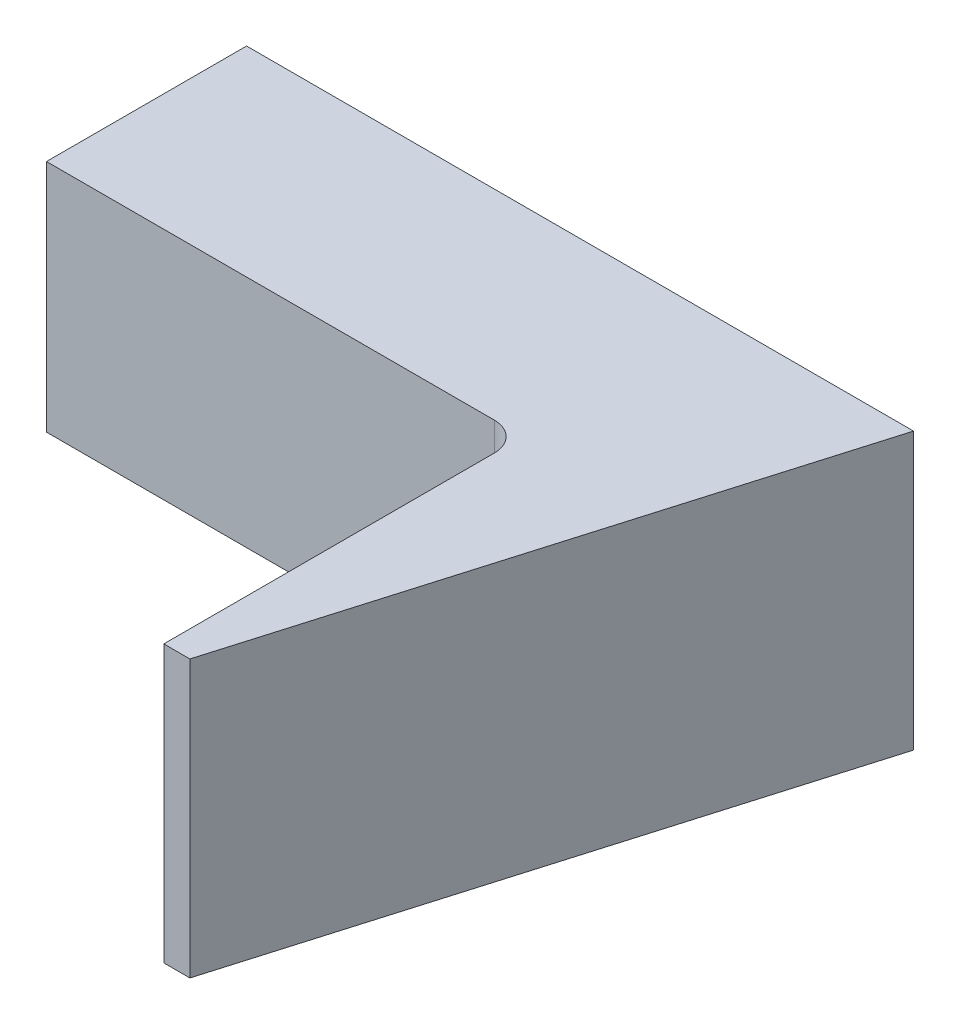
ISO-10303-21;
HEADER;
FILE_DESCRIPTION(('STEP AP214'),'2;1');
FILE_NAME('part.step','',(''),(''),'','','');
FILE_SCHEMA(('AUTOMOTIVE_DESIGN { 1 0 10303 214 1 1 1 1 }'));
ENDSEC;
DATA;
#1=APPLICATION_CONTEXT('core data for automotive mechanical design processes');
#2=APPLICATION_PROTOCOL_DEFINITION('international standard','automotive_design',2000,#1);
#3=PRODUCT_CONTEXT('',#1,'mechanical');
#4=PRODUCT('Part','Part','',(#3));
#5=PRODUCT_RELATED_PRODUCT_CATEGORY('part','',(#4));
#6=PRODUCT_DEFINITION_FORMATION('','',#4);
#7=PRODUCT_DEFINITION_CONTEXT('part definition',#1,'design');
#8=PRODUCT_DEFINITION('design','',#6,#7);
#9=PRODUCT_DEFINITION_SHAPE('','',#8);
#10=(LENGTH_UNIT() NAMED_UNIT(*) SI_UNIT(.MILLI.,.METRE.));
#11=(NAMED_UNIT(*) PLANE_ANGLE_UNIT() SI_UNIT($,.RADIAN.));
#12=(NAMED_UNIT(*) SI_UNIT($,.STERADIAN.) SOLID_ANGLE_UNIT());
#13=UNCERTAINTY_MEASURE_WITH_UNIT(LENGTH_MEASURE(1.E-05),#10,'distance_accuracy_value','');
#14=(GEOMETRIC_REPRESENTATION_CONTEXT(3) GLOBAL_UNCERTAINTY_ASSIGNED_CONTEXT((#13)) GLOBAL_UNIT_ASSIGNED_CONTEXT((#10,
#11,#12)) REPRESENTATION_CONTEXT('',''));
#15=CARTESIAN_POINT('',(0.,0.,0.));
#16=DIRECTION('',(0.,0.,1.));
#17=DIRECTION('',(1.,0.,0.));
#18=AXIS2_PLACEMENT_3D('',#15,#16,#17);
#19=CARTESIAN_POINT('',(0.,0.,5.334));
#20=DIRECTION('',(0.,0.,1.));
#21=DIRECTION('',(1.,0.,0.));
#22=AXIS2_PLACEMENT_3D('',#19,#20,#21);
#23=PLANE('',#22);
#24=DIRECTION('',(0.,-1.,0.));
#25=VECTOR('',#24,1.);
#26=CARTESIAN_POINT('',(-5.08,0.,5.334));
#27=LINE('',#26,#25);
#28=CARTESIAN_POINT('',(-5.08,3.683,5.334));
#29=VERTEX_POINT('',#28);
#30=CARTESIAN_POINT('',(-5.08,3.1496,5.334));
#31=VERTEX_POINT('',#30);
#32=EDGE_CURVE('E57',#29,#31,#27,.T.);
#33=ORIENTED_EDGE('',*,*,#32,.F.);
#34=DIRECTION('',(1.,0.,0.));
#35=VECTOR('',#34,1.);
#36=CARTESIAN_POINT('',(0.,3.683,5.334));
#37=LINE('',#36,#35);
#38=CARTESIAN_POINT('',(-5.842,3.683,5.334));
#39=VERTEX_POINT('',#38);
#40=EDGE_CURVE('E179',#39,#29,#37,.T.);
#41=ORIENTED_EDGE('',*,*,#40,.F.);
#42=DIRECTION('',(0.,-1.,0.));
#43=VECTOR('',#42,1.);
#44=CARTESIAN_POINT('',(-5.842,0.,5.334));
#45=LINE('',#44,#43);
#46=CARTESIAN_POINT('',(-5.842,9.398,5.334));
#47=VERTEX_POINT('',#46);
#48=EDGE_CURVE('E202',#39,#47,#45,.F.);
#49=ORIENTED_EDGE('',*,*,#48,.T.);
#50=DIRECTION('',(-1.,0.,0.));
#51=VECTOR('',#50,1.);
#52=CARTESIAN_POINT('',(-25.4,9.398,5.334));
#53=LINE('',#52,#51);
#54=CARTESIAN_POINT('',(-17.78,9.398,5.334));
#55=VERTEX_POINT('',#54);
#56=EDGE_CURVE('E193',#47,#55,#53,.T.);
#57=ORIENTED_EDGE('',*,*,#56,.T.);
#58=DIRECTION('',(0.,-1.,0.));
#59=VECTOR('',#58,1.);
#60=CARTESIAN_POINT('',(-17.78,49.5659336330003,5.334));
#61=LINE('',#60,#59);
#62=CARTESIAN_POINT('',(-17.78,3.1496,5.334));
#63=VERTEX_POINT('',#62);
#64=EDGE_CURVE('E159',#55,#63,#61,.T.);
#65=ORIENTED_EDGE('',*,*,#64,.T.);
#66=DIRECTION('',(1.,0.,0.));
#67=VECTOR('',#66,1.);
#68=CARTESIAN_POINT('',(-49.8353799348337,3.1496,5.334));
#69=LINE('',#68,#67);
#70=EDGE_CURVE('E156',#63,#31,#69,.T.);
#71=ORIENTED_EDGE('',*,*,#70,.T.);
#72=EDGE_LOOP('',(#33,#41,#49,#57,#65,#71));
#73=FACE_BOUND('',#72,.T.);
#74=ADVANCED_FACE('F41',(#73),#23,.T.);
#75=CARTESIAN_POINT('',(0.,0.,0.));
#76=DIRECTION('',(0.,0.,1.));
#77=DIRECTION('',(1.,0.,0.));
#78=AXIS2_PLACEMENT_3D('',#75,#76,#77);
#79=PLANE('',#78);
#80=DIRECTION('',(0.,-1.,0.));
#81=VECTOR('',#80,1.);
#82=CARTESIAN_POINT('',(-17.78,49.5659336330003,0.));
#83=LINE('',#82,#81);
#84=CARTESIAN_POINT('',(-17.78,9.398,0.));
#85=VERTEX_POINT('',#84);
#86=CARTESIAN_POINT('',(-17.78,3.1496,0.));
#87=VERTEX_POINT('',#86);
#88=EDGE_CURVE('E121',#85,#87,#83,.T.);
#89=ORIENTED_EDGE('',*,*,#88,.F.);
#90=DIRECTION('',(-1.,0.,0.));
#91=VECTOR('',#90,1.);
#92=CARTESIAN_POINT('',(-25.4,9.398,0.));
#93=LINE('',#92,#91);
#94=CARTESIAN_POINT('',(0.,9.398,0.));
#95=VERTEX_POINT('',#94);
#96=EDGE_CURVE('E198',#95,#85,#93,.T.);
#97=ORIENTED_EDGE('',*,*,#96,.F.);
#98=DIRECTION('',(0.,1.,0.));
#99=VECTOR('',#98,1.);
#100=CARTESIAN_POINT('',(0.,9.398,0.));
#101=LINE('',#100,#99);
#102=CARTESIAN_POINT('',(0.,2.032,0.));
#103=VERTEX_POINT('',#102);
#104=EDGE_CURVE('E213',#103,#95,#101,.T.);
#105=ORIENTED_EDGE('',*,*,#104,.F.);
#106=DIRECTION('',(-1.,0.,0.));
#107=VECTOR('',#106,1.);
#108=CARTESIAN_POINT('',(-5.08,2.032,0.));
#109=LINE('',#108,#107);
#110=CARTESIAN_POINT('',(-5.08,2.032,0.));
#111=VERTEX_POINT('',#110);
#112=EDGE_CURVE('E132',#103,#111,#109,.T.);
#113=ORIENTED_EDGE('',*,*,#112,.T.);
#114=DIRECTION('',(0.,1.,0.));
#115=VECTOR('',#114,1.);
#116=CARTESIAN_POINT('',(-5.08,2.032,0.));
#117=LINE('',#116,#115);
#118=CARTESIAN_POINT('',(-5.08,3.1496,0.));
#119=VERTEX_POINT('',#118);
#120=EDGE_CURVE('E146',#111,#119,#117,.T.);
#121=ORIENTED_EDGE('',*,*,#120,.T.);
#122=DIRECTION('',(1.,0.,0.));
#123=VECTOR('',#122,1.);
#124=CARTESIAN_POINT('',(-49.8353799348337,3.1496,0.));
#125=LINE('',#124,#123);
#126=EDGE_CURVE('E155',#87,#119,#125,.T.);
#127=ORIENTED_EDGE('',*,*,#126,.F.);
#128=EDGE_LOOP('',(#89,#97,#105,#113,#121,#127));
#129=FACE_BOUND('',#128,.T.);
#130=ADVANCED_FACE('F235',(#129),#79,.F.);
#131=CARTESIAN_POINT('',(-5.08,9.398,18.034));
#132=DIRECTION('',(1.,0.,0.));
#133=DIRECTION('',(0.,1.,0.));
#134=AXIS2_PLACEMENT_3D('',#131,#132,#133);
#135=PLANE('',#134);
#136=DIRECTION('',(0.,-1.,0.));
#137=VECTOR('',#136,1.);
#138=CARTESIAN_POINT('',(-5.08,58.1697636452282,14.9067716481666));
#139=LINE('',#138,#137);
#140=CARTESIAN_POINT('',(-5.08,9.398,14.9067716481666));
#141=VERTEX_POINT('',#140);
#142=CARTESIAN_POINT('',(-5.08,2.032,14.9067716481666));
#143=VERTEX_POINT('',#142);
#144=EDGE_CURVE('E137',#141,#143,#139,.T.);
#145=ORIENTED_EDGE('',*,*,#144,.F.);
#146=DIRECTION('',(0.,0.,-1.));
#147=VECTOR('',#146,1.);
#148=CARTESIAN_POINT('',(-5.08,9.398,18.034));
#149=LINE('',#148,#147);
#150=CARTESIAN_POINT('',(-5.08,9.398,6.096));
#151=VERTEX_POINT('',#150);
#152=EDGE_CURVE('E190',#141,#151,#149,.T.);
#153=ORIENTED_EDGE('',*,*,#152,.T.);
#154=DIRECTION('',(0.,-1.,0.));
#155=VECTOR('',#154,1.);
#156=CARTESIAN_POINT('',(-5.08,9.398,6.096));
#157=LINE('',#156,#155);
#158=CARTESIAN_POINT('',(-5.08,3.683,6.096));
#159=VERTEX_POINT('',#158);
#160=EDGE_CURVE('E197',#151,#159,#157,.T.);
#161=ORIENTED_EDGE('',*,*,#160,.T.);
#162=DIRECTION('',(0.,0.,1.));
#163=VECTOR('',#162,1.);
#164=CARTESIAN_POINT('',(-5.08,3.683,18.034));
#165=LINE('',#164,#163);
#166=EDGE_CURVE('E152',#29,#159,#165,.T.);
#167=ORIENTED_EDGE('',*,*,#166,.F.);
#168=ORIENTED_EDGE('',*,*,#32,.T.);
#169=DIRECTION('',(0.,0.,1.));
#170=VECTOR('',#169,1.);
#171=CARTESIAN_POINT('',(-5.08,3.1496,0.));
#172=LINE('',#171,#170);
#173=EDGE_CURVE('E11',#119,#31,#172,.T.);
#174=ORIENTED_EDGE('',*,*,#173,.F.);
#175=ORIENTED_EDGE('',*,*,#120,.F.);
#176=DIRECTION('',(0.,0.,1.));
#177=VECTOR('',#176,1.);
#178=CARTESIAN_POINT('',(-5.08,2.032,14.9067716481666));
#179=LINE('',#178,#177);
#180=EDGE_CURVE('E143',#111,#143,#179,.T.);
#181=ORIENTED_EDGE('',*,*,#180,.T.);
#182=EDGE_LOOP('',(#145,#153,#161,#167,#168,#174,#175,#181));
#183=FACE_BOUND('',#182,.T.);
#184=ADVANCED_FACE('F232',(#183),#135,.F.);
#185=CARTESIAN_POINT('',(0.,58.6656349788099,0.));
#186=DIRECTION('',(0.959365501571271,0.,0.28216632399155));
#187=DIRECTION('',(0.28216632399155,0.,-0.959365501571271));
#188=AXIS2_PLACEMENT_3D('',#185,#186,#187);
#189=PLANE('',#188);
#190=DIRECTION('',(0.,-1.,0.));
#191=VECTOR('',#190,1.);
#192=CARTESIAN_POINT('',(-4.38434460240193,58.1697636452282,14.9067716481666));
#193=LINE('',#192,#191);
#194=CARTESIAN_POINT('',(-4.38434460240193,9.398,14.9067716481666));
#195=VERTEX_POINT('',#194);
#196=CARTESIAN_POINT('',(-4.38434460240193,2.032,14.9067716481666));
#197=VERTEX_POINT('',#196);
#198=EDGE_CURVE('E111',#195,#197,#193,.T.);
#199=ORIENTED_EDGE('',*,*,#198,.T.);
#200=DIRECTION('',(0.28216632399155,0.,-0.959365501571271));
#201=VECTOR('',#200,1.);
#202=CARTESIAN_POINT('',(0.,2.032,0.));
#203=LINE('',#202,#201);
#204=EDGE_CURVE('E114',#197,#103,#203,.T.);
#205=ORIENTED_EDGE('',*,*,#204,.T.);
#206=ORIENTED_EDGE('',*,*,#104,.T.);
#207=DIRECTION('',(-0.28216632399155,0.,0.959365501571271));
#208=VECTOR('',#207,1.);
#209=CARTESIAN_POINT('',(-3.4662101910828,9.398,11.7851146496815));
#210=LINE('',#209,#208);
#211=EDGE_CURVE('E116',#95,#195,#210,.T.);
#212=ORIENTED_EDGE('',*,*,#211,.T.);
#213=EDGE_LOOP('',(#199,#205,#206,#212));
#214=FACE_BOUND('',#213,.T.);
#215=ADVANCED_FACE('F113',(#214),#189,.T.);
#216=CARTESIAN_POINT('',(0.,3.683,18.034));
#217=DIRECTION('',(0.,1.,0.));
#218=DIRECTION('',(-1.,0.,0.));
#219=AXIS2_PLACEMENT_3D('',#216,#217,#218);
#220=PLANE('',#219);
#221=ORIENTED_EDGE('',*,*,#40,.T.);
#222=ORIENTED_EDGE('',*,*,#166,.T.);
#223=CARTESIAN_POINT('',(-5.842,3.683,6.096));
#224=DIRECTION('',(0.,1.,0.));
#225=DIRECTION('',(-1.,0.,0.));
#226=AXIS2_PLACEMENT_3D('',#223,#224,#225);
#227=CIRCLE('',#226,0.762);
#228=EDGE_CURVE('E205',#159,#39,#227,.T.);
#229=ORIENTED_EDGE('',*,*,#228,.T.);
#230=EDGE_LOOP('',(#221,#222,#229));
#231=FACE_BOUND('',#230,.T.);
#232=ADVANCED_FACE('F256',(#231),#220,.F.);
#233=CARTESIAN_POINT('',(-25.4,9.398,5.334));
#234=DIRECTION('',(0.,-1.,0.));
#235=DIRECTION('',(0.,0.,-1.));
#236=AXIS2_PLACEMENT_3D('',#233,#234,#235);
#237=PLANE('',#236);
#238=CARTESIAN_POINT('',(-5.842,9.398,6.096));
#239=DIRECTION('',(0.,-1.,0.));
#240=DIRECTION('',(0.,0.,-1.));
#241=AXIS2_PLACEMENT_3D('',#238,#239,#240);
#242=CIRCLE('',#241,0.762);
#243=EDGE_CURVE('E122',#47,#151,#242,.T.);
#244=ORIENTED_EDGE('',*,*,#243,.T.);
#245=ORIENTED_EDGE('',*,*,#152,.F.);
#246=DIRECTION('',(1.,0.,0.));
#247=VECTOR('',#246,1.);
#248=CARTESIAN_POINT('',(-25.4,9.398,14.9067716481666));
#249=LINE('',#248,#247);
#250=EDGE_CURVE('E174',#141,#195,#249,.T.);
#251=ORIENTED_EDGE('',*,*,#250,.T.);
#252=ORIENTED_EDGE('',*,*,#211,.F.);
#253=ORIENTED_EDGE('',*,*,#96,.T.);
#254=DIRECTION('',(0.,0.,1.));
#255=VECTOR('',#254,1.);
#256=CARTESIAN_POINT('',(-17.78,9.398,5.334));
#257=LINE('',#256,#255);
#258=EDGE_CURVE('E165',#85,#55,#257,.T.);
#259=ORIENTED_EDGE('',*,*,#258,.T.);
#260=ORIENTED_EDGE('',*,*,#56,.F.);
#261=EDGE_LOOP('',(#244,#245,#251,#252,#253,#259,#260));
#262=FACE_BOUND('',#261,.T.);
#263=ADVANCED_FACE('F225',(#262),#237,.F.);
#264=CARTESIAN_POINT('',(-5.842,9.398,6.096));
#265=DIRECTION('',(0.,-1.,0.));
#266=DIRECTION('',(1.,0.,0.));
#267=AXIS2_PLACEMENT_3D('',#264,#265,#266);
#268=CYLINDRICAL_SURFACE('',#267,0.762);
#269=ORIENTED_EDGE('',*,*,#243,.F.);
#270=ORIENTED_EDGE('',*,*,#48,.F.);
#271=ORIENTED_EDGE('',*,*,#228,.F.);
#272=ORIENTED_EDGE('',*,*,#160,.F.);
#273=EDGE_LOOP('',(#269,#270,#271,#272));
#274=FACE_BOUND('',#273,.T.);
#275=ADVANCED_FACE('F43',(#274),#268,.F.);
#276=CARTESIAN_POINT('',(-5.08,58.1697636452282,14.9067716481666));
#277=DIRECTION('',(0.,0.,-1.));
#278=DIRECTION('',(-1.,0.,0.));
#279=AXIS2_PLACEMENT_3D('',#276,#277,#278);
#280=PLANE('',#279);
#281=ORIENTED_EDGE('',*,*,#144,.T.);
#282=DIRECTION('',(1.,0.,0.));
#283=VECTOR('',#282,1.);
#284=CARTESIAN_POINT('',(-4.38434460240193,2.032,14.9067716481666));
#285=LINE('',#284,#283);
#286=EDGE_CURVE('E129',#143,#197,#285,.T.);
#287=ORIENTED_EDGE('',*,*,#286,.T.);
#288=ORIENTED_EDGE('',*,*,#198,.F.);
#289=ORIENTED_EDGE('',*,*,#250,.F.);
#290=EDGE_LOOP('',(#281,#287,#288,#289));
#291=FACE_BOUND('',#290,.T.);
#292=ADVANCED_FACE('F135',(#291),#280,.F.);
#293=CARTESIAN_POINT('',(-17.78,49.5659336330003,0.));
#294=DIRECTION('',(1.,0.,0.));
#295=DIRECTION('',(0.,0.,-1.));
#296=AXIS2_PLACEMENT_3D('',#293,#294,#295);
#297=PLANE('',#296);
#298=ORIENTED_EDGE('',*,*,#88,.T.);
#299=DIRECTION('',(0.,0.,1.));
#300=VECTOR('',#299,1.);
#301=CARTESIAN_POINT('',(-17.78,3.1496,0.));
#302=LINE('',#301,#300);
#303=EDGE_CURVE('E50',#87,#63,#302,.T.);
#304=ORIENTED_EDGE('',*,*,#303,.T.);
#305=ORIENTED_EDGE('',*,*,#64,.F.);
#306=ORIENTED_EDGE('',*,*,#258,.F.);
#307=EDGE_LOOP('',(#298,#304,#305,#306));
#308=FACE_BOUND('',#307,.T.);
#309=ADVANCED_FACE('F217',(#308),#297,.F.);
#310=CARTESIAN_POINT('',(-49.8353799348337,3.1496,0.));
#311=DIRECTION('',(0.,1.,0.));
#312=DIRECTION('',(0.,0.,1.));
#313=AXIS2_PLACEMENT_3D('',#310,#311,#312);
#314=PLANE('',#313);
#315=ORIENTED_EDGE('',*,*,#126,.T.);
#316=ORIENTED_EDGE('',*,*,#173,.T.);
#317=ORIENTED_EDGE('',*,*,#70,.F.);
#318=ORIENTED_EDGE('',*,*,#303,.F.);
#319=EDGE_LOOP('',(#315,#316,#317,#318));
#320=FACE_BOUND('',#319,.T.);
#321=ADVANCED_FACE('F238',(#320),#314,.F.);
#322=CARTESIAN_POINT('',(0.,2.032,0.));
#323=DIRECTION('',(0.,-1.,0.));
#324=DIRECTION('',(0.,0.,-1.));
#325=AXIS2_PLACEMENT_3D('',#322,#323,#324);
#326=PLANE('',#325);
#327=ORIENTED_EDGE('',*,*,#286,.F.);
#328=ORIENTED_EDGE('',*,*,#180,.F.);
#329=ORIENTED_EDGE('',*,*,#112,.F.);
#330=ORIENTED_EDGE('',*,*,#204,.F.);
#331=EDGE_LOOP('',(#327,#328,#329,#330));
#332=FACE_BOUND('',#331,.T.);
#333=ADVANCED_FACE('F127',(#332),#326,.T.);
#334=CLOSED_SHELL('',(#74,#130,#184,#215,#232,#263,#275,#292,#309,#321,#333));
#335=MANIFOLD_SOLID_BREP('B2',#334);
#336=ADVANCED_BREP_SHAPE_REPRESENTATION('',(#18,#335),#14);
#337=SHAPE_DEFINITION_REPRESENTATION(#9,#336);
ENDSEC;
END-ISO-10303-21;
